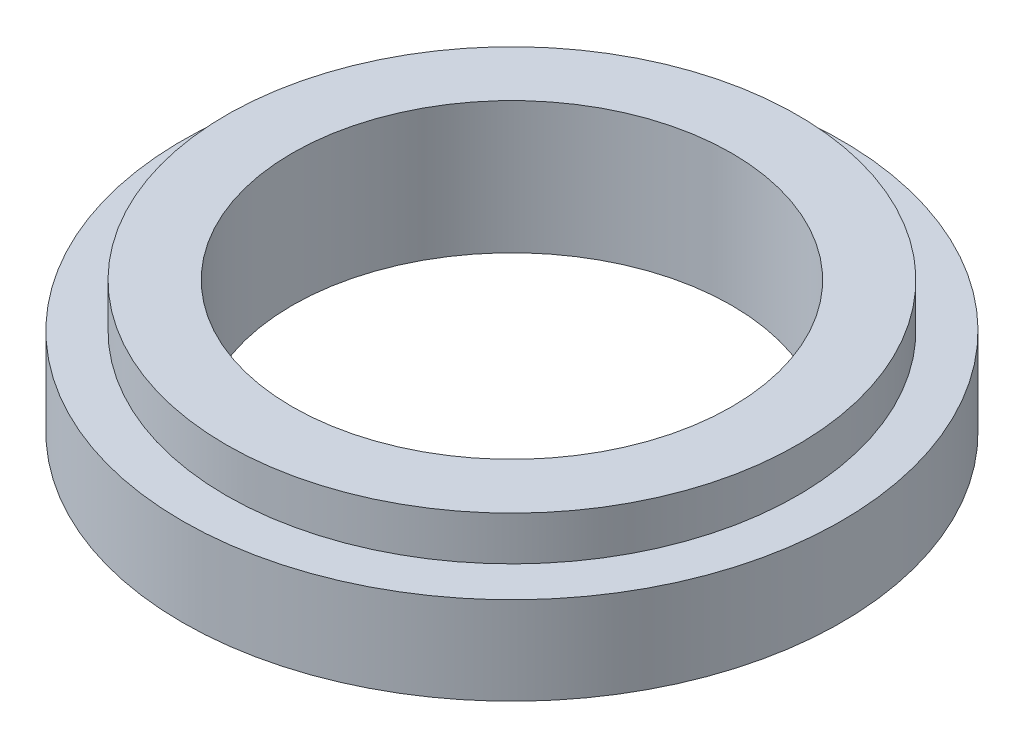
ISO-10303-21;
HEADER;
FILE_DESCRIPTION(('STEP AP214'),'2;1');
FILE_NAME('part.step','',(''),(''),'','','');
FILE_SCHEMA(('AUTOMOTIVE_DESIGN { 1 0 10303 214 1 1 1 1 }'));
ENDSEC;
DATA;
#1=APPLICATION_CONTEXT('core data for automotive mechanical design processes');
#2=APPLICATION_PROTOCOL_DEFINITION('international standard','automotive_design',2000,#1);
#3=PRODUCT_CONTEXT('',#1,'mechanical');
#4=PRODUCT('Part','Part','',(#3));
#5=PRODUCT_RELATED_PRODUCT_CATEGORY('part','',(#4));
#6=PRODUCT_DEFINITION_FORMATION('','',#4);
#7=PRODUCT_DEFINITION_CONTEXT('part definition',#1,'design');
#8=PRODUCT_DEFINITION('design','',#6,#7);
#9=PRODUCT_DEFINITION_SHAPE('','',#8);
#10=(LENGTH_UNIT() NAMED_UNIT(*) SI_UNIT(.MILLI.,.METRE.));
#11=(NAMED_UNIT(*) PLANE_ANGLE_UNIT() SI_UNIT($,.RADIAN.));
#12=(NAMED_UNIT(*) SI_UNIT($,.STERADIAN.) SOLID_ANGLE_UNIT());
#13=UNCERTAINTY_MEASURE_WITH_UNIT(LENGTH_MEASURE(1.E-05),#10,'distance_accuracy_value','');
#14=(GEOMETRIC_REPRESENTATION_CONTEXT(3) GLOBAL_UNCERTAINTY_ASSIGNED_CONTEXT((#13)) GLOBAL_UNIT_ASSIGNED_CONTEXT((#10,
#11,#12)) REPRESENTATION_CONTEXT('',''));
#15=CARTESIAN_POINT('',(0.,0.,0.));
#16=DIRECTION('',(0.,0.,1.));
#17=DIRECTION('',(1.,0.,0.));
#18=AXIS2_PLACEMENT_3D('',#15,#16,#17);
#19=CARTESIAN_POINT('',(0.,1.5,0.));
#20=DIRECTION('',(0.,1.,0.));
#21=DIRECTION('',(0.,0.,1.));
#22=AXIS2_PLACEMENT_3D('',#19,#20,#21);
#23=PLANE('',#22);
#24=CARTESIAN_POINT('',(0.,1.5,0.));
#25=DIRECTION('',(0.,1.,0.));
#26=DIRECTION('',(0.,0.,1.));
#27=AXIS2_PLACEMENT_3D('',#24,#25,#26);
#28=CIRCLE('',#27,2.5);
#29=CARTESIAN_POINT('',(0.,1.5,2.5));
#30=VERTEX_POINT('',#29);
#31=EDGE_CURVE('E46',#30,#30,#28,.T.);
#32=ORIENTED_EDGE('',*,*,#31,.F.);
#33=EDGE_LOOP('',(#32));
#34=FACE_BOUND('',#33,.T.);
#35=CARTESIAN_POINT('',(0.,1.5,0.));
#36=DIRECTION('',(0.,1.,0.));
#37=DIRECTION('',(0.,0.,1.));
#38=AXIS2_PLACEMENT_3D('',#35,#36,#37);
#39=CIRCLE('',#38,3.25);
#40=CARTESIAN_POINT('',(0.,1.5,3.25));
#41=VERTEX_POINT('',#40);
#42=EDGE_CURVE('E58',#41,#41,#39,.T.);
#43=ORIENTED_EDGE('',*,*,#42,.T.);
#44=EDGE_LOOP('',(#43));
#45=FACE_BOUND('',#44,.T.);
#46=ADVANCED_FACE('F39',(#34,#45),#23,.T.);
#47=CARTESIAN_POINT('',(0.,1.5,0.));
#48=DIRECTION('',(0.,-1.,0.));
#49=DIRECTION('',(0.,0.,-1.));
#50=AXIS2_PLACEMENT_3D('',#47,#48,#49);
#51=CYLINDRICAL_SURFACE('',#50,3.75);
#52=CARTESIAN_POINT('',(0.,0.,0.));
#53=DIRECTION('',(0.,1.,0.));
#54=DIRECTION('',(0.,0.,1.));
#55=AXIS2_PLACEMENT_3D('',#52,#53,#54);
#56=CIRCLE('',#55,3.75);
#57=CARTESIAN_POINT('',(0.,0.,3.75));
#58=VERTEX_POINT('',#57);
#59=EDGE_CURVE('E10',#58,#58,#56,.T.);
#60=ORIENTED_EDGE('',*,*,#59,.T.);
#61=EDGE_LOOP('',(#60));
#62=FACE_BOUND('',#61,.T.);
#63=CARTESIAN_POINT('',(0.,1.,0.));
#64=DIRECTION('',(0.,1.,0.));
#65=DIRECTION('',(0.,0.,1.));
#66=AXIS2_PLACEMENT_3D('',#63,#64,#65);
#67=CIRCLE('',#66,3.75);
#68=CARTESIAN_POINT('',(0.,1.,3.75));
#69=VERTEX_POINT('',#68);
#70=EDGE_CURVE('E54',#69,#69,#67,.T.);
#71=ORIENTED_EDGE('',*,*,#70,.F.);
#72=EDGE_LOOP('',(#71));
#73=FACE_BOUND('',#72,.T.);
#74=ADVANCED_FACE('F41',(#62,#73),#51,.T.);
#75=CARTESIAN_POINT('',(0.,0.,0.));
#76=DIRECTION('',(0.,1.,0.));
#77=DIRECTION('',(0.,0.,1.));
#78=AXIS2_PLACEMENT_3D('',#75,#76,#77);
#79=PLANE('',#78);
#80=ORIENTED_EDGE('',*,*,#59,.F.);
#81=EDGE_LOOP('',(#80));
#82=FACE_BOUND('',#81,.T.);
#83=CARTESIAN_POINT('',(0.,0.,0.));
#84=DIRECTION('',(0.,1.,0.));
#85=DIRECTION('',(0.,0.,1.));
#86=AXIS2_PLACEMENT_3D('',#83,#84,#85);
#87=CIRCLE('',#86,2.5);
#88=CARTESIAN_POINT('',(0.,0.,2.5));
#89=VERTEX_POINT('',#88);
#90=EDGE_CURVE('E49',#89,#89,#87,.T.);
#91=ORIENTED_EDGE('',*,*,#90,.T.);
#92=EDGE_LOOP('',(#91));
#93=FACE_BOUND('',#92,.T.);
#94=ADVANCED_FACE('F80',(#82,#93),#79,.F.);
#95=CARTESIAN_POINT('',(0.,1.5,0.));
#96=DIRECTION('',(0.,-1.,0.));
#97=DIRECTION('',(0.,0.,-1.));
#98=AXIS2_PLACEMENT_3D('',#95,#96,#97);
#99=CYLINDRICAL_SURFACE('',#98,2.5);
#100=ORIENTED_EDGE('',*,*,#31,.T.);
#101=EDGE_LOOP('',(#100));
#102=FACE_BOUND('',#101,.T.);
#103=ORIENTED_EDGE('',*,*,#90,.F.);
#104=EDGE_LOOP('',(#103));
#105=FACE_BOUND('',#104,.T.);
#106=ADVANCED_FACE('F75',(#102,#105),#99,.F.);
#107=CARTESIAN_POINT('',(0.,1.,0.));
#108=DIRECTION('',(0.,1.,0.));
#109=DIRECTION('',(0.,0.,1.));
#110=AXIS2_PLACEMENT_3D('',#107,#108,#109);
#111=PLANE('',#110);
#112=CARTESIAN_POINT('',(0.,1.,0.));
#113=DIRECTION('',(0.,1.,0.));
#114=DIRECTION('',(0.,0.,1.));
#115=AXIS2_PLACEMENT_3D('',#112,#113,#114);
#116=CIRCLE('',#115,3.25);
#117=CARTESIAN_POINT('',(0.,1.,3.25));
#118=VERTEX_POINT('',#117);
#119=EDGE_CURVE('E56',#118,#118,#116,.T.);
#120=ORIENTED_EDGE('',*,*,#119,.F.);
#121=EDGE_LOOP('',(#120));
#122=FACE_BOUND('',#121,.T.);
#123=ORIENTED_EDGE('',*,*,#70,.T.);
#124=EDGE_LOOP('',(#123));
#125=FACE_BOUND('',#124,.T.);
#126=ADVANCED_FACE('F66',(#122,#125),#111,.T.);
#127=CARTESIAN_POINT('',(0.,1.,0.));
#128=DIRECTION('',(0.,1.,0.));
#129=DIRECTION('',(0.,0.,1.));
#130=AXIS2_PLACEMENT_3D('',#127,#128,#129);
#131=CYLINDRICAL_SURFACE('',#130,3.25);
#132=ORIENTED_EDGE('',*,*,#119,.T.);
#133=EDGE_LOOP('',(#132));
#134=FACE_BOUND('',#133,.T.);
#135=ORIENTED_EDGE('',*,*,#42,.F.);
#136=EDGE_LOOP('',(#135));
#137=FACE_BOUND('',#136,.T.);
#138=ADVANCED_FACE('F67',(#134,#137),#131,.T.);
#139=CLOSED_SHELL('',(#46,#74,#94,#106,#126,#138));
#140=MANIFOLD_SOLID_BREP('B2',#139);
#141=ADVANCED_BREP_SHAPE_REPRESENTATION('',(#18,#140),#14);
#142=SHAPE_DEFINITION_REPRESENTATION(#9,#141);
ENDSEC;
END-ISO-10303-21;
